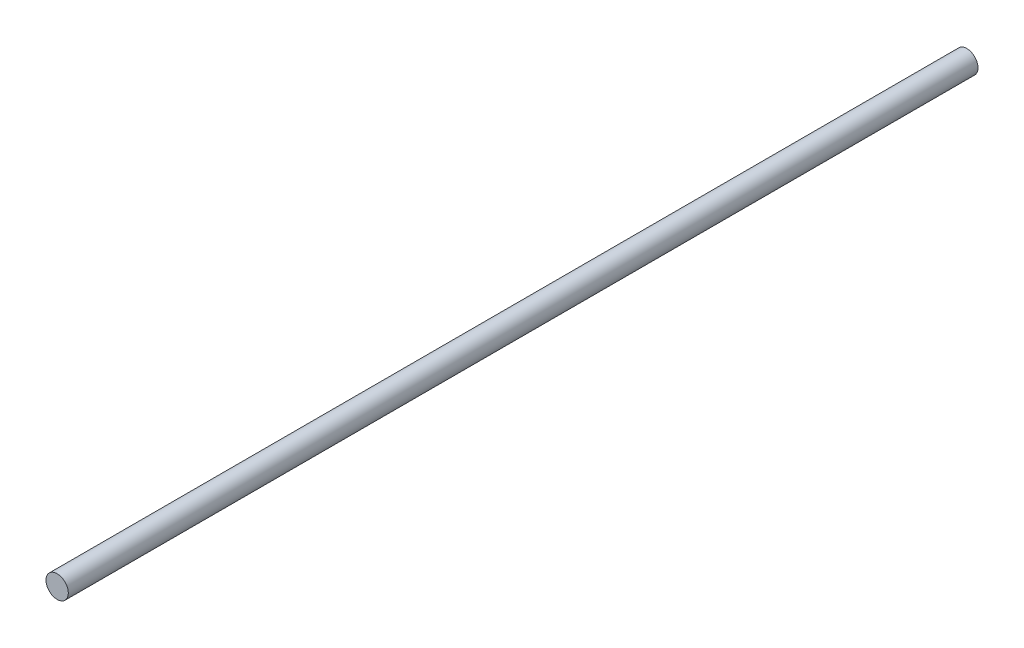
ISO-10303-21;
HEADER;
FILE_DESCRIPTION(('STEP AP214'),'2;1');
FILE_NAME('part.step','',(''),(''),'','','');
FILE_SCHEMA(('AUTOMOTIVE_DESIGN { 1 0 10303 214 1 1 1 1 }'));
ENDSEC;
DATA;
#1=APPLICATION_CONTEXT('core data for automotive mechanical design processes');
#2=APPLICATION_PROTOCOL_DEFINITION('international standard','automotive_design',2000,#1);
#3=PRODUCT_CONTEXT('',#1,'mechanical');
#4=PRODUCT('Part','Part','',(#3));
#5=PRODUCT_RELATED_PRODUCT_CATEGORY('part','',(#4));
#6=PRODUCT_DEFINITION_FORMATION('','',#4);
#7=PRODUCT_DEFINITION_CONTEXT('part definition',#1,'design');
#8=PRODUCT_DEFINITION('design','',#6,#7);
#9=PRODUCT_DEFINITION_SHAPE('','',#8);
#10=(LENGTH_UNIT() NAMED_UNIT(*) SI_UNIT(.MILLI.,.METRE.));
#11=(NAMED_UNIT(*) PLANE_ANGLE_UNIT() SI_UNIT($,.RADIAN.));
#12=(NAMED_UNIT(*) SI_UNIT($,.STERADIAN.) SOLID_ANGLE_UNIT());
#13=UNCERTAINTY_MEASURE_WITH_UNIT(LENGTH_MEASURE(1.E-05),#10,'distance_accuracy_value','');
#14=(GEOMETRIC_REPRESENTATION_CONTEXT(3) GLOBAL_UNCERTAINTY_ASSIGNED_CONTEXT((#13)) GLOBAL_UNIT_ASSIGNED_CONTEXT((#10,
#11,#12)) REPRESENTATION_CONTEXT('',''));
#15=CARTESIAN_POINT('',(0.,0.,0.));
#16=DIRECTION('',(0.,0.,1.));
#17=DIRECTION('',(1.,0.,0.));
#18=AXIS2_PLACEMENT_3D('',#15,#16,#17);
#19=CARTESIAN_POINT('',(0.,0.,7.8));
#20=DIRECTION('',(0.,0.,-1.));
#21=DIRECTION('',(-1.,0.,0.));
#22=AXIS2_PLACEMENT_3D('',#19,#20,#21);
#23=PLANE('',#22);
#24=CARTESIAN_POINT('',(0.,0.,7.8));
#25=DIRECTION('',(0.,0.,1.));
#26=DIRECTION('',(1.,0.,0.));
#27=AXIS2_PLACEMENT_3D('',#24,#25,#26);
#28=CIRCLE('',#27,4.);
#29=CARTESIAN_POINT('',(4.,0.,7.8));
#30=VERTEX_POINT('',#29);
#31=EDGE_CURVE('E10',#30,#30,#28,.T.);
#32=ORIENTED_EDGE('',*,*,#31,.T.);
#33=EDGE_LOOP('',(#32));
#34=FACE_BOUND('',#33,.T.);
#35=ADVANCED_FACE('F37',(#34),#23,.F.);
#36=CARTESIAN_POINT('',(0.,0.,7.8));
#37=DIRECTION('',(0.,0.,1.));
#38=DIRECTION('',(1.,0.,0.));
#39=AXIS2_PLACEMENT_3D('',#36,#37,#38);
#40=CYLINDRICAL_SURFACE('',#39,4.);
#41=ORIENTED_EDGE('',*,*,#31,.F.);
#42=EDGE_LOOP('',(#41));
#43=FACE_BOUND('',#42,.T.);
#44=CARTESIAN_POINT('',(0.,0.,-318.047675392386));
#45=DIRECTION('',(0.,0.,1.));
#46=DIRECTION('',(1.,0.,0.));
#47=AXIS2_PLACEMENT_3D('',#44,#45,#46);
#48=CIRCLE('',#47,4.);
#49=CARTESIAN_POINT('',(4.,0.,-318.047675392386));
#50=VERTEX_POINT('',#49);
#51=EDGE_CURVE('E44',#50,#50,#48,.T.);
#52=ORIENTED_EDGE('',*,*,#51,.T.);
#53=EDGE_LOOP('',(#52));
#54=FACE_BOUND('',#53,.T.);
#55=ADVANCED_FACE('F51',(#43,#54),#40,.T.);
#56=CARTESIAN_POINT('',(0.,0.,-318.047675392386));
#57=DIRECTION('',(0.,0.,1.));
#58=DIRECTION('',(1.,0.,0.));
#59=AXIS2_PLACEMENT_3D('',#56,#57,#58);
#60=PLANE('',#59);
#61=ORIENTED_EDGE('',*,*,#51,.F.);
#62=EDGE_LOOP('',(#61));
#63=FACE_BOUND('',#62,.T.);
#64=ADVANCED_FACE('F53',(#63),#60,.F.);
#65=CLOSED_SHELL('',(#35,#55,#64));
#66=MANIFOLD_SOLID_BREP('B2',#65);
#67=ADVANCED_BREP_SHAPE_REPRESENTATION('',(#18,#66),#14);
#68=SHAPE_DEFINITION_REPRESENTATION(#9,#67);
ENDSEC;
END-ISO-10303-21;
